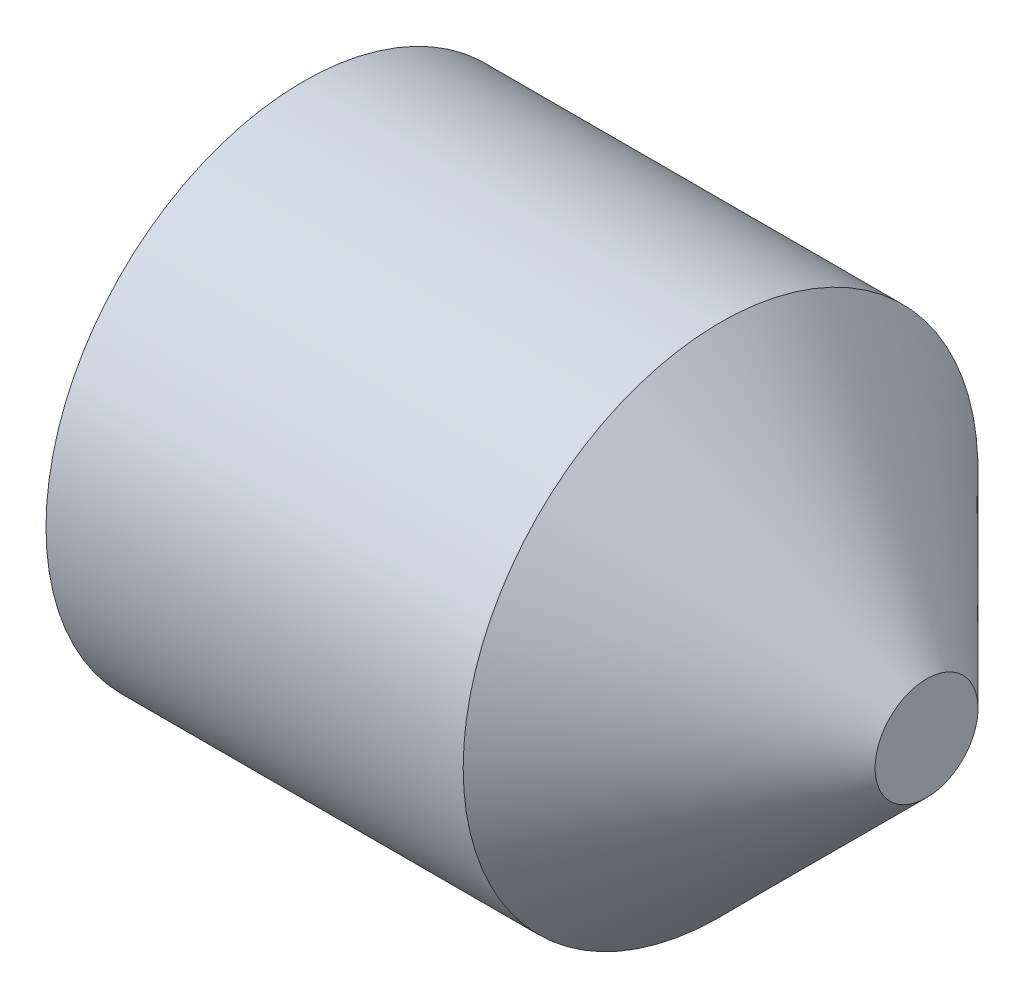
ISO-10303-21;
HEADER;
FILE_DESCRIPTION(('STEP AP214'),'2;1');
FILE_NAME('part.step','',(''),(''),'','','');
FILE_SCHEMA(('AUTOMOTIVE_DESIGN { 1 0 10303 214 1 1 1 1 }'));
ENDSEC;
DATA;
#1=APPLICATION_CONTEXT('core data for automotive mechanical design processes');
#2=APPLICATION_PROTOCOL_DEFINITION('international standard','automotive_design',2000,#1);
#3=PRODUCT_CONTEXT('',#1,'mechanical');
#4=PRODUCT('Part','Part','',(#3));
#5=PRODUCT_RELATED_PRODUCT_CATEGORY('part','',(#4));
#6=PRODUCT_DEFINITION_FORMATION('','',#4);
#7=PRODUCT_DEFINITION_CONTEXT('part definition',#1,'design');
#8=PRODUCT_DEFINITION('design','',#6,#7);
#9=PRODUCT_DEFINITION_SHAPE('','',#8);
#10=(LENGTH_UNIT() NAMED_UNIT(*) SI_UNIT(.MILLI.,.METRE.));
#11=(NAMED_UNIT(*) PLANE_ANGLE_UNIT() SI_UNIT($,.RADIAN.));
#12=(NAMED_UNIT(*) SI_UNIT($,.STERADIAN.) SOLID_ANGLE_UNIT());
#13=UNCERTAINTY_MEASURE_WITH_UNIT(LENGTH_MEASURE(1.E-05),#10,'distance_accuracy_value','');
#14=(GEOMETRIC_REPRESENTATION_CONTEXT(3) GLOBAL_UNCERTAINTY_ASSIGNED_CONTEXT((#13)) GLOBAL_UNIT_ASSIGNED_CONTEXT((#10,
#11,#12)) REPRESENTATION_CONTEXT('',''));
#15=CARTESIAN_POINT('',(0.,0.,0.));
#16=DIRECTION('',(0.,0.,1.));
#17=DIRECTION('',(1.,0.,0.));
#18=AXIS2_PLACEMENT_3D('',#15,#16,#17);
#19=CARTESIAN_POINT('',(0.,0.,0.));
#20=DIRECTION('',(-1.,0.,0.));
#21=DIRECTION('',(0.,0.,1.));
#22=AXIS2_PLACEMENT_3D('',#19,#20,#21);
#23=PLANE('',#22);
#24=CARTESIAN_POINT('',(0.,0.,0.));
#25=DIRECTION('',(-1.,0.,0.));
#26=DIRECTION('',(0.,0.,1.));
#27=AXIS2_PLACEMENT_3D('',#24,#25,#26);
#28=CIRCLE('',#27,10.352);
#29=CARTESIAN_POINT('',(0.,0.,10.352));
#30=VERTEX_POINT('',#29);
#31=EDGE_CURVE('E11',#30,#30,#28,.T.);
#32=ORIENTED_EDGE('',*,*,#31,.T.);
#33=EDGE_LOOP('',(#32));
#34=FACE_BOUND('',#33,.T.);
#35=DIRECTION('',(0.,0.,-1.));
#36=VECTOR('',#35,1.);
#37=CARTESIAN_POINT('',(0.,6.,3.46410161513775));
#38=LINE('',#37,#36);
#39=CARTESIAN_POINT('',(0.,6.,3.46410161513775));
#40=VERTEX_POINT('',#39);
#41=CARTESIAN_POINT('',(0.,6.,-3.46410161513776));
#42=VERTEX_POINT('',#41);
#43=EDGE_CURVE('E126',#40,#42,#38,.T.);
#44=ORIENTED_EDGE('',*,*,#43,.F.);
#45=DIRECTION('',(0.,-0.866025403784439,0.5));
#46=VECTOR('',#45,1.);
#47=CARTESIAN_POINT('',(0.,6.,3.46410161513775));
#48=LINE('',#47,#46);
#49=CARTESIAN_POINT('',(0.,0.,6.9282032302755));
#50=VERTEX_POINT('',#49);
#51=EDGE_CURVE('E48',#40,#50,#48,.T.);
#52=ORIENTED_EDGE('',*,*,#51,.T.);
#53=DIRECTION('',(0.,0.866025403784439,0.5));
#54=VECTOR('',#53,1.);
#55=CARTESIAN_POINT('',(0.,-5.99999999999999,3.46410161513775));
#56=LINE('',#55,#54);
#57=CARTESIAN_POINT('',(0.,-5.99999999999999,3.46410161513775));
#58=VERTEX_POINT('',#57);
#59=EDGE_CURVE('E117',#58,#50,#56,.T.);
#60=ORIENTED_EDGE('',*,*,#59,.F.);
#61=DIRECTION('',(0.,0.,-1.));
#62=VECTOR('',#61,1.);
#63=CARTESIAN_POINT('',(0.,-5.99999999999999,3.46410161513775));
#64=LINE('',#63,#62);
#65=CARTESIAN_POINT('',(0.,-5.99999999999999,-3.46410161513776));
#66=VERTEX_POINT('',#65);
#67=EDGE_CURVE('E120',#58,#66,#64,.T.);
#68=ORIENTED_EDGE('',*,*,#67,.T.);
#69=DIRECTION('',(0.,0.866025403784438,-0.5));
#70=VECTOR('',#69,1.);
#71=CARTESIAN_POINT('',(0.,-5.99999999999999,-3.46410161513776));
#72=LINE('',#71,#70);
#73=CARTESIAN_POINT('',(0.,0.,-6.92820323027551));
#74=VERTEX_POINT('',#73);
#75=EDGE_CURVE('E123',#66,#74,#72,.T.);
#76=ORIENTED_EDGE('',*,*,#75,.T.);
#77=DIRECTION('',(0.,-0.866025403784439,-0.5));
#78=VECTOR('',#77,1.);
#79=CARTESIAN_POINT('',(0.,6.,-3.46410161513776));
#80=LINE('',#79,#78);
#81=EDGE_CURVE('E106',#42,#74,#80,.T.);
#82=ORIENTED_EDGE('',*,*,#81,.F.);
#83=EDGE_LOOP('',(#44,#52,#60,#68,#76,#82));
#84=FACE_BOUND('',#83,.T.);
#85=ADVANCED_FACE('F34',(#34,#84),#23,.T.);
#86=CARTESIAN_POINT('',(0.,0.,0.));
#87=DIRECTION('',(1.,0.,0.));
#88=DIRECTION('',(0.,0.,-1.));
#89=AXIS2_PLACEMENT_3D('',#86,#87,#88);
#90=CONICAL_SURFACE('',#89,10.352,1.0471975511966);
#91=CARTESIAN_POINT('',(0.951473243624499,0.,0.));
#92=DIRECTION('',(-1.,0.,0.));
#93=DIRECTION('',(0.,0.,1.));
#94=AXIS2_PLACEMENT_3D('',#91,#92,#93);
#95=CIRCLE('',#94,12.);
#96=CARTESIAN_POINT('',(0.951473243624499,0.,12.));
#97=VERTEX_POINT('',#96);
#98=EDGE_CURVE('E41',#97,#97,#95,.T.);
#99=ORIENTED_EDGE('',*,*,#98,.T.);
#100=EDGE_LOOP('',(#99));
#101=FACE_BOUND('',#100,.T.);
#102=ORIENTED_EDGE('',*,*,#31,.F.);
#103=EDGE_LOOP('',(#102));
#104=FACE_BOUND('',#103,.T.);
#105=ADVANCED_FACE('F143',(#101,#104),#90,.T.);
#106=CARTESIAN_POINT('',(-12.7,0.,0.));
#107=DIRECTION('',(-1.,0.,0.));
#108=DIRECTION('',(0.,0.,1.));
#109=AXIS2_PLACEMENT_3D('',#106,#107,#108);
#110=CYLINDRICAL_SURFACE('',#109,12.);
#111=CARTESIAN_POINT('',(20.4,0.,0.));
#112=DIRECTION('',(-1.,0.,0.));
#113=DIRECTION('',(0.,0.,1.));
#114=AXIS2_PLACEMENT_3D('',#111,#112,#113);
#115=CIRCLE('',#114,12.);
#116=CARTESIAN_POINT('',(20.4,0.,12.));
#117=VERTEX_POINT('',#116);
#118=EDGE_CURVE('E138',#117,#117,#115,.T.);
#119=ORIENTED_EDGE('',*,*,#118,.T.);
#120=EDGE_LOOP('',(#119));
#121=FACE_BOUND('',#120,.T.);
#122=ORIENTED_EDGE('',*,*,#98,.F.);
#123=EDGE_LOOP('',(#122));
#124=FACE_BOUND('',#123,.T.);
#125=ADVANCED_FACE('F146',(#121,#124),#110,.T.);
#126=CARTESIAN_POINT('',(30.,0.,0.));
#127=DIRECTION('',(-1.,0.,0.));
#128=DIRECTION('',(0.,0.,1.));
#129=AXIS2_PLACEMENT_3D('',#126,#127,#128);
#130=CONICAL_SURFACE('',#129,2.4,0.78539816339745);
#131=ORIENTED_EDGE('',*,*,#118,.F.);
#132=EDGE_LOOP('',(#131));
#133=FACE_BOUND('',#132,.T.);
#134=CARTESIAN_POINT('',(30.,0.,0.));
#135=DIRECTION('',(-1.,0.,0.));
#136=DIRECTION('',(0.,0.,1.));
#137=AXIS2_PLACEMENT_3D('',#134,#135,#136);
#138=CIRCLE('',#137,2.4);
#139=CARTESIAN_POINT('',(30.,0.,2.4));
#140=VERTEX_POINT('',#139);
#141=EDGE_CURVE('E135',#140,#140,#138,.T.);
#142=ORIENTED_EDGE('',*,*,#141,.T.);
#143=EDGE_LOOP('',(#142));
#144=FACE_BOUND('',#143,.T.);
#145=ADVANCED_FACE('F148',(#133,#144),#130,.T.);
#146=CARTESIAN_POINT('',(30.,0.,0.));
#147=DIRECTION('',(-1.,0.,0.));
#148=DIRECTION('',(0.,0.,1.));
#149=AXIS2_PLACEMENT_3D('',#146,#147,#148);
#150=PLANE('',#149);
#151=ORIENTED_EDGE('',*,*,#141,.F.);
#152=EDGE_LOOP('',(#151));
#153=FACE_BOUND('',#152,.T.);
#154=ADVANCED_FACE('F155',(#153),#150,.F.);
#155=CARTESIAN_POINT('',(10.,6.,3.46410161513775));
#156=DIRECTION('',(0.,-0.5,-0.866025403784439));
#157=DIRECTION('',(0.,0.866025403784439,-0.5));
#158=AXIS2_PLACEMENT_3D('',#155,#156,#157);
#159=PLANE('',#158);
#160=ORIENTED_EDGE('',*,*,#51,.F.);
#161=DIRECTION('',(-1.,0.,0.));
#162=VECTOR('',#161,1.);
#163=CARTESIAN_POINT('',(10.,6.,3.46410161513775));
#164=LINE('',#163,#162);
#165=CARTESIAN_POINT('',(10.,6.,3.46410161513775));
#166=VERTEX_POINT('',#165);
#167=EDGE_CURVE('E53',#166,#40,#164,.T.);
#168=ORIENTED_EDGE('',*,*,#167,.F.);
#169=DIRECTION('',(0.,-0.866025403784439,0.5));
#170=VECTOR('',#169,1.);
#171=CARTESIAN_POINT('',(10.,6.,3.46410161513775));
#172=LINE('',#171,#170);
#173=CARTESIAN_POINT('',(10.,0.,6.9282032302755));
#174=VERTEX_POINT('',#173);
#175=EDGE_CURVE('E80',#166,#174,#172,.T.);
#176=ORIENTED_EDGE('',*,*,#175,.T.);
#177=DIRECTION('',(-1.,0.,0.));
#178=VECTOR('',#177,1.);
#179=CARTESIAN_POINT('',(10.,0.,6.9282032302755));
#180=LINE('',#179,#178);
#181=EDGE_CURVE('E133',#174,#50,#180,.T.);
#182=ORIENTED_EDGE('',*,*,#181,.T.);
#183=EDGE_LOOP('',(#160,#168,#176,#182));
#184=FACE_BOUND('',#183,.T.);
#185=ADVANCED_FACE('F186',(#184),#159,.T.);
#186=CARTESIAN_POINT('',(10.,-5.99999999999999,3.46410161513775));
#187=DIRECTION('',(0.,-0.5,0.866025403784439));
#188=DIRECTION('',(0.,-0.866025403784439,-0.5));
#189=AXIS2_PLACEMENT_3D('',#186,#187,#188);
#190=PLANE('',#189);
#191=ORIENTED_EDGE('',*,*,#59,.T.);
#192=ORIENTED_EDGE('',*,*,#181,.F.);
#193=DIRECTION('',(0.,0.866025403784439,0.5));
#194=VECTOR('',#193,1.);
#195=CARTESIAN_POINT('',(10.,-5.99999999999999,3.46410161513775));
#196=LINE('',#195,#194);
#197=CARTESIAN_POINT('',(10.,-5.99999999999999,3.46410161513775));
#198=VERTEX_POINT('',#197);
#199=EDGE_CURVE('E265',#198,#174,#196,.T.);
#200=ORIENTED_EDGE('',*,*,#199,.F.);
#201=DIRECTION('',(-1.,0.,0.));
#202=VECTOR('',#201,1.);
#203=CARTESIAN_POINT('',(10.,-5.99999999999999,3.46410161513775));
#204=LINE('',#203,#202);
#205=EDGE_CURVE('E131',#198,#58,#204,.T.);
#206=ORIENTED_EDGE('',*,*,#205,.T.);
#207=EDGE_LOOP('',(#191,#192,#200,#206));
#208=FACE_BOUND('',#207,.T.);
#209=ADVANCED_FACE('F182',(#208),#190,.F.);
#210=CARTESIAN_POINT('',(10.,-5.99999999999999,3.46410161513775));
#211=DIRECTION('',(0.,1.,0.));
#212=DIRECTION('',(0.,0.,1.));
#213=AXIS2_PLACEMENT_3D('',#210,#211,#212);
#214=PLANE('',#213);
#215=ORIENTED_EDGE('',*,*,#67,.F.);
#216=ORIENTED_EDGE('',*,*,#205,.F.);
#217=DIRECTION('',(0.,0.,-1.));
#218=VECTOR('',#217,1.);
#219=CARTESIAN_POINT('',(10.,-5.99999999999999,3.46410161513775));
#220=LINE('',#219,#218);
#221=CARTESIAN_POINT('',(10.,-5.99999999999999,-3.46410161513776));
#222=VERTEX_POINT('',#221);
#223=EDGE_CURVE('E101',#198,#222,#220,.T.);
#224=ORIENTED_EDGE('',*,*,#223,.T.);
#225=DIRECTION('',(-1.,0.,0.));
#226=VECTOR('',#225,1.);
#227=CARTESIAN_POINT('',(10.,-5.99999999999999,-3.46410161513776));
#228=LINE('',#227,#226);
#229=EDGE_CURVE('E96',#222,#66,#228,.T.);
#230=ORIENTED_EDGE('',*,*,#229,.T.);
#231=EDGE_LOOP('',(#215,#216,#224,#230));
#232=FACE_BOUND('',#231,.T.);
#233=ADVANCED_FACE('F179',(#232),#214,.T.);
#234=CARTESIAN_POINT('',(10.,-5.99999999999999,-3.46410161513776));
#235=DIRECTION('',(0.,0.5,0.866025403784438));
#236=DIRECTION('',(0.,-0.866025403784439,0.5));
#237=AXIS2_PLACEMENT_3D('',#234,#235,#236);
#238=PLANE('',#237);
#239=ORIENTED_EDGE('',*,*,#75,.F.);
#240=ORIENTED_EDGE('',*,*,#229,.F.);
#241=DIRECTION('',(0.,0.866025403784438,-0.5));
#242=VECTOR('',#241,1.);
#243=CARTESIAN_POINT('',(10.,-5.99999999999999,-3.46410161513776));
#244=LINE('',#243,#242);
#245=CARTESIAN_POINT('',(10.,0.,-6.92820323027551));
#246=VERTEX_POINT('',#245);
#247=EDGE_CURVE('E91',#222,#246,#244,.T.);
#248=ORIENTED_EDGE('',*,*,#247,.T.);
#249=DIRECTION('',(-1.,0.,0.));
#250=VECTOR('',#249,1.);
#251=CARTESIAN_POINT('',(10.,0.,-6.92820323027551));
#252=LINE('',#251,#250);
#253=EDGE_CURVE('E95',#246,#74,#252,.T.);
#254=ORIENTED_EDGE('',*,*,#253,.T.);
#255=EDGE_LOOP('',(#239,#240,#248,#254));
#256=FACE_BOUND('',#255,.T.);
#257=ADVANCED_FACE('F94',(#256),#238,.T.);
#258=CARTESIAN_POINT('',(10.,6.,-3.46410161513776));
#259=DIRECTION('',(0.,0.5,-0.866025403784439));
#260=DIRECTION('',(0.,0.866025403784439,0.5));
#261=AXIS2_PLACEMENT_3D('',#258,#259,#260);
#262=PLANE('',#261);
#263=ORIENTED_EDGE('',*,*,#81,.T.);
#264=ORIENTED_EDGE('',*,*,#253,.F.);
#265=DIRECTION('',(0.,-0.866025403784439,-0.5));
#266=VECTOR('',#265,1.);
#267=CARTESIAN_POINT('',(10.,6.,-3.46410161513776));
#268=LINE('',#267,#266);
#269=CARTESIAN_POINT('',(10.,6.,-3.46410161513776));
#270=VERTEX_POINT('',#269);
#271=EDGE_CURVE('E100',#270,#246,#268,.T.);
#272=ORIENTED_EDGE('',*,*,#271,.F.);
#273=DIRECTION('',(-1.,0.,0.));
#274=VECTOR('',#273,1.);
#275=CARTESIAN_POINT('',(10.,6.,-3.46410161513776));
#276=LINE('',#275,#274);
#277=EDGE_CURVE('E76',#270,#42,#276,.T.);
#278=ORIENTED_EDGE('',*,*,#277,.T.);
#279=EDGE_LOOP('',(#263,#264,#272,#278));
#280=FACE_BOUND('',#279,.T.);
#281=ADVANCED_FACE('F103',(#280),#262,.F.);
#282=CARTESIAN_POINT('',(10.,6.,3.46410161513775));
#283=DIRECTION('',(0.,1.,0.));
#284=DIRECTION('',(0.,0.,1.));
#285=AXIS2_PLACEMENT_3D('',#282,#283,#284);
#286=PLANE('',#285);
#287=ORIENTED_EDGE('',*,*,#43,.T.);
#288=ORIENTED_EDGE('',*,*,#277,.F.);
#289=DIRECTION('',(0.,0.,-1.));
#290=VECTOR('',#289,1.);
#291=CARTESIAN_POINT('',(10.,6.,3.46410161513775));
#292=LINE('',#291,#290);
#293=EDGE_CURVE('E111',#166,#270,#292,.T.);
#294=ORIENTED_EDGE('',*,*,#293,.F.);
#295=ORIENTED_EDGE('',*,*,#167,.T.);
#296=EDGE_LOOP('',(#287,#288,#294,#295));
#297=FACE_BOUND('',#296,.T.);
#298=ADVANCED_FACE('F167',(#297),#286,.F.);
#299=CARTESIAN_POINT('',(10.,6.,3.46410161513775));
#300=DIRECTION('',(1.,0.,0.));
#301=DIRECTION('',(0.,0.,-1.));
#302=AXIS2_PLACEMENT_3D('',#299,#300,#301);
#303=PLANE('',#302);
#304=ORIENTED_EDGE('',*,*,#175,.F.);
#305=ORIENTED_EDGE('',*,*,#293,.T.);
#306=ORIENTED_EDGE('',*,*,#271,.T.);
#307=ORIENTED_EDGE('',*,*,#247,.F.);
#308=ORIENTED_EDGE('',*,*,#223,.F.);
#309=ORIENTED_EDGE('',*,*,#199,.T.);
#310=EDGE_LOOP('',(#304,#305,#306,#307,#308,#309));
#311=FACE_BOUND('',#310,.T.);
#312=ADVANCED_FACE('F109',(#311),#303,.F.);
#313=CLOSED_SHELL('',(#85,#105,#125,#145,#154,#185,#209,#233,#257,#281,#298,#312));
#314=MANIFOLD_SOLID_BREP('B2',#313);
#315=ADVANCED_BREP_SHAPE_REPRESENTATION('',(#18,#314),#14);
#316=SHAPE_DEFINITION_REPRESENTATION(#9,#315);
ENDSEC;
END-ISO-10303-21;
